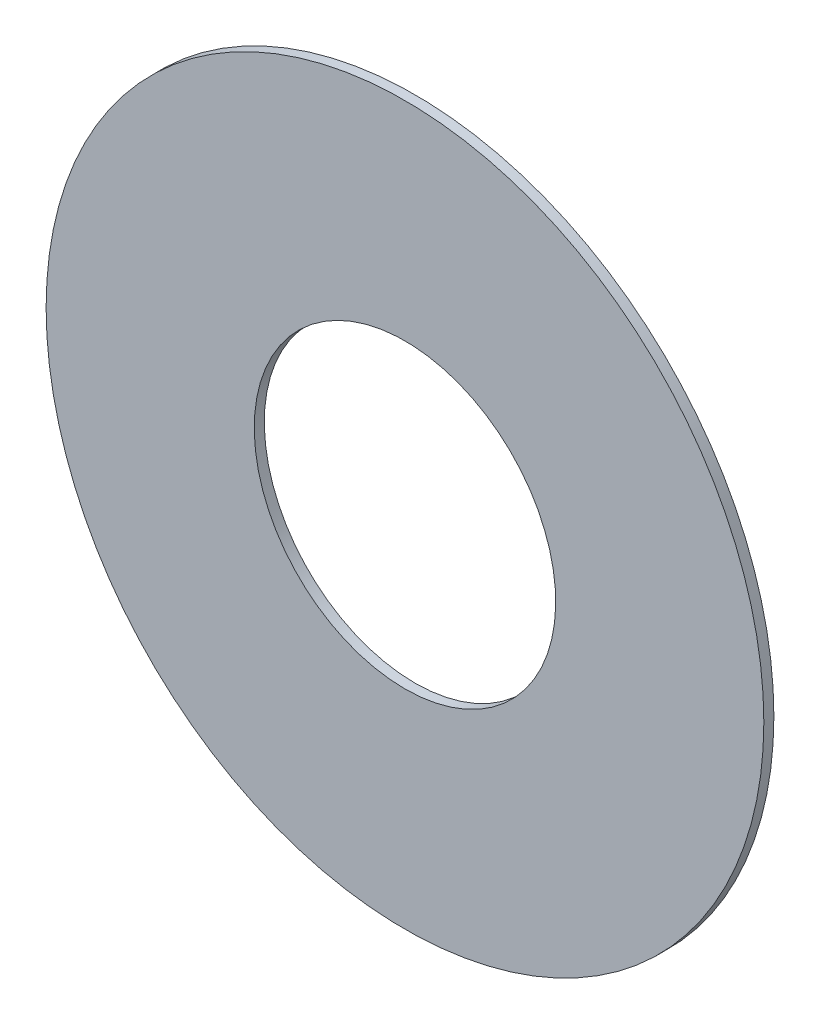
ISO-10303-21;
HEADER;
FILE_DESCRIPTION(('STEP AP214'),'2;1');
FILE_NAME('part.step','',(''),(''),'','','');
FILE_SCHEMA(('AUTOMOTIVE_DESIGN { 1 0 10303 214 1 1 1 1 }'));
ENDSEC;
DATA;
#1=APPLICATION_CONTEXT('core data for automotive mechanical design processes');
#2=APPLICATION_PROTOCOL_DEFINITION('international standard','automotive_design',2000,#1);
#3=PRODUCT_CONTEXT('',#1,'mechanical');
#4=PRODUCT('Part','Part','',(#3));
#5=PRODUCT_RELATED_PRODUCT_CATEGORY('part','',(#4));
#6=PRODUCT_DEFINITION_FORMATION('','',#4);
#7=PRODUCT_DEFINITION_CONTEXT('part definition',#1,'design');
#8=PRODUCT_DEFINITION('design','',#6,#7);
#9=PRODUCT_DEFINITION_SHAPE('','',#8);
#10=(LENGTH_UNIT() NAMED_UNIT(*) SI_UNIT(.MILLI.,.METRE.));
#11=(NAMED_UNIT(*) PLANE_ANGLE_UNIT() SI_UNIT($,.RADIAN.));
#12=(NAMED_UNIT(*) SI_UNIT($,.STERADIAN.) SOLID_ANGLE_UNIT());
#13=UNCERTAINTY_MEASURE_WITH_UNIT(LENGTH_MEASURE(1.E-05),#10,'distance_accuracy_value','');
#14=(GEOMETRIC_REPRESENTATION_CONTEXT(3) GLOBAL_UNCERTAINTY_ASSIGNED_CONTEXT((#13)) GLOBAL_UNIT_ASSIGNED_CONTEXT((#10,
#11,#12)) REPRESENTATION_CONTEXT('',''));
#15=CARTESIAN_POINT('',(0.,0.,0.));
#16=DIRECTION('',(0.,0.,1.));
#17=DIRECTION('',(1.,0.,0.));
#18=AXIS2_PLACEMENT_3D('',#15,#16,#17);
#19=CARTESIAN_POINT('',(158.952,-121.234,-0.045));
#20=DIRECTION('',(0.,0.,-1.));
#21=DIRECTION('',(0.,-1.,0.));
#22=AXIS2_PLACEMENT_3D('',#19,#20,#21);
#23=CYLINDRICAL_SURFACE('',#22,0.525);
#24=CARTESIAN_POINT('',(158.952,-121.234,1.67));
#25=DIRECTION('',(0.,0.,-1.));
#26=DIRECTION('',(0.,-1.,0.));
#27=AXIS2_PLACEMENT_3D('',#24,#25,#26);
#28=CIRCLE('',#27,0.525);
#29=CARTESIAN_POINT('',(158.952,-121.759,1.67));
#30=VERTEX_POINT('',#29);
#31=EDGE_CURVE('E20',#30,#30,#28,.T.);
#32=ORIENTED_EDGE('',*,*,#31,.T.);
#33=DIRECTION('',(0.,0.,1.));
#34=VECTOR('',#33,1.);
#35=CARTESIAN_POINT('',(158.952,-121.759,-0.045));
#36=LINE('',#35,#34);
#37=CARTESIAN_POINT('',(158.952,-121.759,1.705));
#38=VERTEX_POINT('',#37);
#39=EDGE_CURVE('E11',#30,#38,#36,.T.);
#40=ORIENTED_EDGE('',*,*,#39,.T.);
#41=CARTESIAN_POINT('',(158.952,-121.234,1.705));
#42=DIRECTION('',(0.,0.,-1.));
#43=DIRECTION('',(0.,-1.,0.));
#44=AXIS2_PLACEMENT_3D('',#41,#42,#43);
#45=CIRCLE('',#44,0.525);
#46=EDGE_CURVE('E68',#38,#38,#45,.T.);
#47=ORIENTED_EDGE('',*,*,#46,.F.);
#48=ORIENTED_EDGE('',*,*,#39,.F.);
#49=EDGE_LOOP('',(#32,#40,#47,#48));
#50=FACE_BOUND('',#49,.T.);
#51=ADVANCED_FACE('F17',(#50),#23,.F.);
#52=CARTESIAN_POINT('',(158.952,-121.234,1.67));
#53=DIRECTION('',(0.,0.,1.));
#54=DIRECTION('',(1.,0.,0.));
#55=AXIS2_PLACEMENT_3D('',#52,#53,#54);
#56=PLANE('',#55);
#57=ORIENTED_EDGE('',*,*,#31,.F.);
#58=EDGE_LOOP('',(#57));
#59=FACE_BOUND('',#58,.T.);
#60=CARTESIAN_POINT('',(158.952,-121.234,1.67));
#61=DIRECTION('',(0.,0.,1.));
#62=DIRECTION('',(1.,0.,0.));
#63=AXIS2_PLACEMENT_3D('',#60,#61,#62);
#64=CIRCLE('',#63,1.25);
#65=CARTESIAN_POINT('',(160.202,-121.234,1.67));
#66=VERTEX_POINT('',#65);
#67=EDGE_CURVE('E57',#66,#66,#64,.T.);
#68=ORIENTED_EDGE('',*,*,#67,.F.);
#69=EDGE_LOOP('',(#68));
#70=FACE_BOUND('',#69,.T.);
#71=ADVANCED_FACE('F103',(#59,#70),#56,.F.);
#72=CARTESIAN_POINT('',(158.952,-121.234,1.705));
#73=DIRECTION('',(0.,0.,1.));
#74=DIRECTION('',(1.,0.,0.));
#75=AXIS2_PLACEMENT_3D('',#72,#73,#74);
#76=PLANE('',#75);
#77=ORIENTED_EDGE('',*,*,#46,.T.);
#78=EDGE_LOOP('',(#77));
#79=FACE_BOUND('',#78,.T.);
#80=CARTESIAN_POINT('',(158.952,-121.234,1.705));
#81=DIRECTION('',(0.,0.,1.));
#82=DIRECTION('',(1.,0.,0.));
#83=AXIS2_PLACEMENT_3D('',#80,#81,#82);
#84=CIRCLE('',#83,1.25);
#85=CARTESIAN_POINT('',(160.202,-121.234,1.705));
#86=VERTEX_POINT('',#85);
#87=EDGE_CURVE('E55',#86,#86,#84,.T.);
#88=ORIENTED_EDGE('',*,*,#87,.T.);
#89=EDGE_LOOP('',(#88));
#90=FACE_BOUND('',#89,.T.);
#91=ADVANCED_FACE('F61',(#79,#90),#76,.T.);
#92=CARTESIAN_POINT('',(158.952,-121.234,1.67));
#93=DIRECTION('',(0.,0.,1.));
#94=DIRECTION('',(1.,0.,0.));
#95=AXIS2_PLACEMENT_3D('',#92,#93,#94);
#96=CYLINDRICAL_SURFACE('',#95,1.25);
#97=ORIENTED_EDGE('',*,*,#87,.F.);
#98=DIRECTION('',(0.,0.,1.));
#99=VECTOR('',#98,1.);
#100=CARTESIAN_POINT('',(160.202,-121.234,1.67));
#101=LINE('',#100,#99);
#102=EDGE_CURVE('E52',#66,#86,#101,.T.);
#103=ORIENTED_EDGE('',*,*,#102,.F.);
#104=ORIENTED_EDGE('',*,*,#67,.T.);
#105=ORIENTED_EDGE('',*,*,#102,.T.);
#106=EDGE_LOOP('',(#97,#103,#104,#105));
#107=FACE_BOUND('',#106,.T.);
#108=ADVANCED_FACE('F54',(#107),#96,.T.);
#109=CLOSED_SHELL('',(#51,#71,#91,#108));
#110=MANIFOLD_SOLID_BREP('B1',#109);
#111=ADVANCED_BREP_SHAPE_REPRESENTATION('',(#18,#110),#14);
#112=SHAPE_DEFINITION_REPRESENTATION(#9,#111);
ENDSEC;
END-ISO-10303-21;
